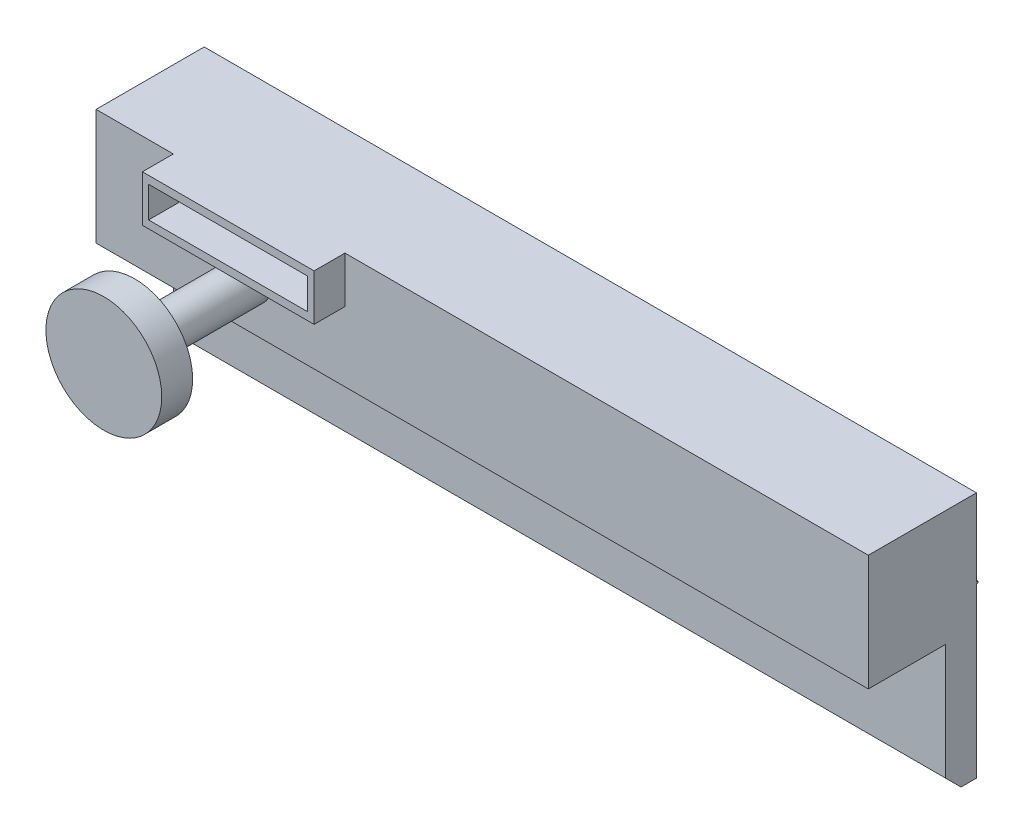
ISO-10303-21;
HEADER;
FILE_DESCRIPTION(('STEP AP214'),'2;1');
FILE_NAME('part.step','',(''),(''),'','','');
FILE_SCHEMA(('AUTOMOTIVE_DESIGN { 1 0 10303 214 1 1 1 1 }'));
ENDSEC;
DATA;
#1=APPLICATION_CONTEXT('core data for automotive mechanical design processes');
#2=APPLICATION_PROTOCOL_DEFINITION('international standard','automotive_design',2000,#1);
#3=PRODUCT_CONTEXT('',#1,'mechanical');
#4=PRODUCT('Part','Part','',(#3));
#5=PRODUCT_RELATED_PRODUCT_CATEGORY('part','',(#4));
#6=PRODUCT_DEFINITION_FORMATION('','',#4);
#7=PRODUCT_DEFINITION_CONTEXT('part definition',#1,'design');
#8=PRODUCT_DEFINITION('design','',#6,#7);
#9=PRODUCT_DEFINITION_SHAPE('','',#8);
#10=(LENGTH_UNIT() NAMED_UNIT(*) SI_UNIT(.MILLI.,.METRE.));
#11=(NAMED_UNIT(*) PLANE_ANGLE_UNIT() SI_UNIT($,.RADIAN.));
#12=(NAMED_UNIT(*) SI_UNIT($,.STERADIAN.) SOLID_ANGLE_UNIT());
#13=UNCERTAINTY_MEASURE_WITH_UNIT(LENGTH_MEASURE(1.E-05),#10,'distance_accuracy_value','');
#14=(GEOMETRIC_REPRESENTATION_CONTEXT(3) GLOBAL_UNCERTAINTY_ASSIGNED_CONTEXT((#13)) GLOBAL_UNIT_ASSIGNED_CONTEXT((#10,
#11,#12)) REPRESENTATION_CONTEXT('',''));
#15=CARTESIAN_POINT('',(0.,0.,0.));
#16=DIRECTION('',(0.,0.,1.));
#17=DIRECTION('',(1.,0.,0.));
#18=AXIS2_PLACEMENT_3D('',#15,#16,#17);
#19=CARTESIAN_POINT('',(0.,0.,0.));
#20=DIRECTION('',(0.,0.,-1.));
#21=DIRECTION('',(-1.,0.,0.));
#22=AXIS2_PLACEMENT_3D('',#19,#20,#21);
#23=PLANE('',#22);
#24=DIRECTION('',(1.,0.,0.));
#25=VECTOR('',#24,1.);
#26=CARTESIAN_POINT('',(127.,27.94,0.));
#27=LINE('',#26,#25);
#28=CARTESIAN_POINT('',(0.,27.94,0.));
#29=VERTEX_POINT('',#28);
#30=CARTESIAN_POINT('',(127.,27.94,0.));
#31=VERTEX_POINT('',#30);
#32=EDGE_CURVE('E185',#29,#31,#27,.T.);
#33=ORIENTED_EDGE('',*,*,#32,.F.);
#34=DIRECTION('',(0.,-1.,0.));
#35=VECTOR('',#34,1.);
#36=CARTESIAN_POINT('',(0.,0.,0.));
#37=LINE('',#36,#35);
#38=CARTESIAN_POINT('',(0.,40.64,0.));
#39=VERTEX_POINT('',#38);
#40=EDGE_CURVE('E314',#39,#29,#37,.T.);
#41=ORIENTED_EDGE('',*,*,#40,.F.);
#42=DIRECTION('',(-1.,0.,0.));
#43=VECTOR('',#42,1.);
#44=CARTESIAN_POINT('',(0.,40.64,0.));
#45=LINE('',#44,#43);
#46=CARTESIAN_POINT('',(127.,40.64,0.));
#47=VERTEX_POINT('',#46);
#48=EDGE_CURVE('E328',#47,#39,#45,.T.);
#49=ORIENTED_EDGE('',*,*,#48,.F.);
#50=DIRECTION('',(0.,1.,0.));
#51=VECTOR('',#50,1.);
#52=CARTESIAN_POINT('',(127.,0.,0.));
#53=LINE('',#52,#51);
#54=EDGE_CURVE('E49',#31,#47,#53,.T.);
#55=ORIENTED_EDGE('',*,*,#54,.F.);
#56=EDGE_LOOP('',(#33,#41,#49,#55));
#57=FACE_BOUND('',#56,.T.);
#58=ADVANCED_FACE('F32',(#57),#23,.T.);
#59=CARTESIAN_POINT('',(0.,0.,17.78));
#60=DIRECTION('',(0.,0.,1.));
#61=DIRECTION('',(1.,0.,0.));
#62=AXIS2_PLACEMENT_3D('',#59,#60,#61);
#63=PLANE('',#62);
#64=CARTESIAN_POINT('',(25.4,29.21,17.78));
#65=DIRECTION('',(0.,0.,1.));
#66=DIRECTION('',(1.,0.,0.));
#67=AXIS2_PLACEMENT_3D('',#64,#65,#66);
#68=CIRCLE('',#67,3.175);
#69=CARTESIAN_POINT('',(28.575,29.21,17.78));
#70=VERTEX_POINT('',#69);
#71=EDGE_CURVE('E273',#70,#70,#68,.T.);
#72=ORIENTED_EDGE('',*,*,#71,.F.);
#73=EDGE_LOOP('',(#72));
#74=FACE_BOUND('',#73,.T.);
#75=DIRECTION('',(1.,0.,0.));
#76=VECTOR('',#75,1.);
#77=CARTESIAN_POINT('',(12.7,33.02,17.78));
#78=LINE('',#77,#76);
#79=CARTESIAN_POINT('',(12.7,33.02,17.78));
#80=VERTEX_POINT('',#79);
#81=CARTESIAN_POINT('',(40.9273018803942,33.02,17.78));
#82=VERTEX_POINT('',#81);
#83=EDGE_CURVE('E253',#80,#82,#78,.T.);
#84=ORIENTED_EDGE('',*,*,#83,.F.);
#85=DIRECTION('',(0.,-1.,0.));
#86=VECTOR('',#85,1.);
#87=CARTESIAN_POINT('',(12.7,40.64,17.78));
#88=LINE('',#87,#86);
#89=CARTESIAN_POINT('',(12.7,40.64,17.78));
#90=VERTEX_POINT('',#89);
#91=EDGE_CURVE('E233',#90,#80,#88,.T.);
#92=ORIENTED_EDGE('',*,*,#91,.F.);
#93=DIRECTION('',(-1.,0.,0.));
#94=VECTOR('',#93,1.);
#95=CARTESIAN_POINT('',(0.,40.64,17.78));
#96=LINE('',#95,#94);
#97=CARTESIAN_POINT('',(0.,40.64,17.78));
#98=VERTEX_POINT('',#97);
#99=EDGE_CURVE('E290',#90,#98,#96,.T.);
#100=ORIENTED_EDGE('',*,*,#99,.T.);
#101=DIRECTION('',(0.,-1.,0.));
#102=VECTOR('',#101,1.);
#103=CARTESIAN_POINT('',(0.,40.64,17.78));
#104=LINE('',#103,#102);
#105=CARTESIAN_POINT('',(0.,21.59,17.78));
#106=VERTEX_POINT('',#105);
#107=EDGE_CURVE('E282',#98,#106,#104,.T.);
#108=ORIENTED_EDGE('',*,*,#107,.T.);
#109=DIRECTION('',(1.,0.,0.));
#110=VECTOR('',#109,1.);
#111=CARTESIAN_POINT('',(0.,21.59,17.78));
#112=LINE('',#111,#110);
#113=CARTESIAN_POINT('',(127.,21.59,17.78));
#114=VERTEX_POINT('',#113);
#115=EDGE_CURVE('E285',#106,#114,#112,.T.);
#116=ORIENTED_EDGE('',*,*,#115,.T.);
#117=DIRECTION('',(0.,1.,0.));
#118=VECTOR('',#117,1.);
#119=CARTESIAN_POINT('',(127.,40.64,17.78));
#120=LINE('',#119,#118);
#121=CARTESIAN_POINT('',(127.,40.64,17.78));
#122=VERTEX_POINT('',#121);
#123=EDGE_CURVE('E287',#114,#122,#120,.T.);
#124=ORIENTED_EDGE('',*,*,#123,.T.);
#125=CARTESIAN_POINT('',(40.9273018803942,40.64,17.78));
#126=VERTEX_POINT('',#125);
#127=EDGE_CURVE('E291',#122,#126,#96,.T.);
#128=ORIENTED_EDGE('',*,*,#127,.T.);
#129=DIRECTION('',(0.,1.,0.));
#130=VECTOR('',#129,1.);
#131=CARTESIAN_POINT('',(40.9273018803942,40.64,17.78));
#132=LINE('',#131,#130);
#133=EDGE_CURVE('E244',#82,#126,#132,.T.);
#134=ORIENTED_EDGE('',*,*,#133,.F.);
#135=EDGE_LOOP('',(#84,#92,#100,#108,#116,#124,#128,#134));
#136=FACE_BOUND('',#135,.T.);
#137=ADVANCED_FACE('F380',(#74,#136),#63,.T.);
#138=CARTESIAN_POINT('',(0.,0.,5.08));
#139=DIRECTION('',(0.,0.,-1.));
#140=DIRECTION('',(-1.,0.,0.));
#141=AXIS2_PLACEMENT_3D('',#138,#139,#140);
#142=PLANE('',#141);
#143=DIRECTION('',(1.,0.,0.));
#144=VECTOR('',#143,1.);
#145=CARTESIAN_POINT('',(0.,21.59,5.08));
#146=LINE('',#145,#144);
#147=CARTESIAN_POINT('',(0.,21.59,5.08));
#148=VERTEX_POINT('',#147);
#149=CARTESIAN_POINT('',(127.,21.59,5.08));
#150=VERTEX_POINT('',#149);
#151=EDGE_CURVE('E279',#148,#150,#146,.T.);
#152=ORIENTED_EDGE('',*,*,#151,.F.);
#153=DIRECTION('',(0.,-1.,0.));
#154=VECTOR('',#153,1.);
#155=CARTESIAN_POINT('',(0.,0.,5.08));
#156=LINE('',#155,#154);
#157=CARTESIAN_POINT('',(0.,2.54000000000003,5.08));
#158=VERTEX_POINT('',#157);
#159=EDGE_CURVE('E333',#148,#158,#156,.T.);
#160=ORIENTED_EDGE('',*,*,#159,.T.);
#161=DIRECTION('',(1.,0.,0.));
#162=VECTOR('',#161,1.);
#163=CARTESIAN_POINT('',(0.,2.54000000000003,5.08));
#164=LINE('',#163,#162);
#165=CARTESIAN_POINT('',(127.,2.54000000000003,5.08));
#166=VERTEX_POINT('',#165);
#167=EDGE_CURVE('E364',#158,#166,#164,.T.);
#168=ORIENTED_EDGE('',*,*,#167,.T.);
#169=DIRECTION('',(0.,1.,0.));
#170=VECTOR('',#169,1.);
#171=CARTESIAN_POINT('',(127.,0.,5.08));
#172=LINE('',#171,#170);
#173=EDGE_CURVE('E302',#166,#150,#172,.T.);
#174=ORIENTED_EDGE('',*,*,#173,.T.);
#175=EDGE_LOOP('',(#152,#160,#168,#174));
#176=FACE_BOUND('',#175,.T.);
#177=ADVANCED_FACE('F386',(#176),#142,.F.);
#178=CARTESIAN_POINT('',(0.,0.,5.08));
#179=DIRECTION('',(1.,0.,0.));
#180=DIRECTION('',(0.,0.,-1.));
#181=AXIS2_PLACEMENT_3D('',#178,#179,#180);
#182=PLANE('',#181);
#183=DIRECTION('',(0.,0.,-1.));
#184=VECTOR('',#183,1.);
#185=CARTESIAN_POINT('',(0.,0.,5.08));
#186=LINE('',#185,#184);
#187=CARTESIAN_POINT('',(0.,0.,2.53999999999996));
#188=VERTEX_POINT('',#187);
#189=CARTESIAN_POINT('',(0.,0.,0.));
#190=VERTEX_POINT('',#189);
#191=EDGE_CURVE('E357',#188,#190,#186,.T.);
#192=ORIENTED_EDGE('',*,*,#191,.F.);
#193=DIRECTION('',(0.,-0.707106781186546,-0.707106781186549));
#194=VECTOR('',#193,1.);
#195=CARTESIAN_POINT('',(0.,2.54000000000003,5.08));
#196=LINE('',#195,#194);
#197=EDGE_CURVE('E11',#188,#158,#196,.F.);
#198=ORIENTED_EDGE('',*,*,#197,.T.);
#199=ORIENTED_EDGE('',*,*,#159,.F.);
#200=DIRECTION('',(0.,0.,-1.));
#201=VECTOR('',#200,1.);
#202=CARTESIAN_POINT('',(0.,21.59,17.78));
#203=LINE('',#202,#201);
#204=EDGE_CURVE('E306',#106,#148,#203,.T.);
#205=ORIENTED_EDGE('',*,*,#204,.F.);
#206=ORIENTED_EDGE('',*,*,#107,.F.);
#207=DIRECTION('',(0.,0.,-1.));
#208=VECTOR('',#207,1.);
#209=CARTESIAN_POINT('',(0.,40.64,5.08));
#210=LINE('',#209,#208);
#211=EDGE_CURVE('E343',#98,#39,#210,.T.);
#212=ORIENTED_EDGE('',*,*,#211,.T.);
#213=ORIENTED_EDGE('',*,*,#40,.T.);
#214=DIRECTION('',(0.,0.,1.));
#215=VECTOR('',#214,1.);
#216=CARTESIAN_POINT('',(0.,27.94,-0.254));
#217=LINE('',#216,#215);
#218=CARTESIAN_POINT('',(0.,27.94,-0.254));
#219=VERTEX_POINT('',#218);
#220=EDGE_CURVE('E194',#219,#29,#217,.T.);
#221=ORIENTED_EDGE('',*,*,#220,.F.);
#222=DIRECTION('',(0.,1.,0.));
#223=VECTOR('',#222,1.);
#224=CARTESIAN_POINT('',(0.,27.94,-0.254));
#225=LINE('',#224,#223);
#226=CARTESIAN_POINT('',(0.,27.686,-0.254));
#227=VERTEX_POINT('',#226);
#228=EDGE_CURVE('E175',#227,#219,#225,.T.);
#229=ORIENTED_EDGE('',*,*,#228,.F.);
#230=DIRECTION('',(0.,0.,1.));
#231=VECTOR('',#230,1.);
#232=CARTESIAN_POINT('',(0.,27.686,-0.254));
#233=LINE('',#232,#231);
#234=CARTESIAN_POINT('',(0.,27.686,0.));
#235=VERTEX_POINT('',#234);
#236=EDGE_CURVE('E172',#227,#235,#233,.T.);
#237=ORIENTED_EDGE('',*,*,#236,.T.);
#238=EDGE_CURVE('E311',#235,#190,#37,.T.);
#239=ORIENTED_EDGE('',*,*,#238,.T.);
#240=EDGE_LOOP('',(#192,#198,#199,#205,#206,#212,#213,#221,#229,#237,#239));
#241=FACE_BOUND('',#240,.T.);
#242=ADVANCED_FACE('F350',(#241),#182,.F.);
#243=CARTESIAN_POINT('',(0.,0.,5.08));
#244=DIRECTION('',(0.,1.,0.));
#245=DIRECTION('',(0.,0.,1.));
#246=AXIS2_PLACEMENT_3D('',#243,#244,#245);
#247=PLANE('',#246);
#248=DIRECTION('',(0.,0.,-1.));
#249=VECTOR('',#248,1.);
#250=CARTESIAN_POINT('',(127.,0.,5.08));
#251=LINE('',#250,#249);
#252=CARTESIAN_POINT('',(127.,0.,2.53999999999996));
#253=VERTEX_POINT('',#252);
#254=CARTESIAN_POINT('',(127.,0.,0.));
#255=VERTEX_POINT('',#254);
#256=EDGE_CURVE('E342',#253,#255,#251,.T.);
#257=ORIENTED_EDGE('',*,*,#256,.F.);
#258=DIRECTION('',(-1.,0.,0.));
#259=VECTOR('',#258,1.);
#260=CARTESIAN_POINT('',(0.,0.,2.53999999999996));
#261=LINE('',#260,#259);
#262=EDGE_CURVE('E41',#253,#188,#261,.T.);
#263=ORIENTED_EDGE('',*,*,#262,.T.);
#264=ORIENTED_EDGE('',*,*,#191,.T.);
#265=DIRECTION('',(1.,0.,0.));
#266=VECTOR('',#265,1.);
#267=CARTESIAN_POINT('',(0.,0.,0.));
#268=LINE('',#267,#266);
#269=EDGE_CURVE('E318',#190,#255,#268,.T.);
#270=ORIENTED_EDGE('',*,*,#269,.T.);
#271=EDGE_LOOP('',(#257,#263,#264,#270));
#272=FACE_BOUND('',#271,.T.);
#273=ADVANCED_FACE('F362',(#272),#247,.F.);
#274=CARTESIAN_POINT('',(127.,0.,5.08));
#275=DIRECTION('',(-1.,0.,0.));
#276=DIRECTION('',(0.,0.,1.));
#277=AXIS2_PLACEMENT_3D('',#274,#275,#276);
#278=PLANE('',#277);
#279=ORIENTED_EDGE('',*,*,#173,.F.);
#280=DIRECTION('',(0.,0.707106781186546,0.707106781186549));
#281=VECTOR('',#280,1.);
#282=CARTESIAN_POINT('',(127.,2.54000000000003,5.08));
#283=LINE('',#282,#281);
#284=EDGE_CURVE('E414',#166,#253,#283,.F.);
#285=ORIENTED_EDGE('',*,*,#284,.T.);
#286=ORIENTED_EDGE('',*,*,#256,.T.);
#287=CARTESIAN_POINT('',(127.,27.686,0.));
#288=VERTEX_POINT('',#287);
#289=EDGE_CURVE('E189',#255,#288,#53,.T.);
#290=ORIENTED_EDGE('',*,*,#289,.T.);
#291=DIRECTION('',(0.,0.,1.));
#292=VECTOR('',#291,1.);
#293=CARTESIAN_POINT('',(127.,27.686,-0.254));
#294=LINE('',#293,#292);
#295=CARTESIAN_POINT('',(127.,27.686,-0.254));
#296=VERTEX_POINT('',#295);
#297=EDGE_CURVE('E170',#296,#288,#294,.T.);
#298=ORIENTED_EDGE('',*,*,#297,.F.);
#299=DIRECTION('',(0.,-1.,0.));
#300=VECTOR('',#299,1.);
#301=CARTESIAN_POINT('',(127.,27.94,-0.254));
#302=LINE('',#301,#300);
#303=CARTESIAN_POINT('',(127.,27.94,-0.254));
#304=VERTEX_POINT('',#303);
#305=EDGE_CURVE('E176',#304,#296,#302,.T.);
#306=ORIENTED_EDGE('',*,*,#305,.F.);
#307=DIRECTION('',(0.,0.,1.));
#308=VECTOR('',#307,1.);
#309=CARTESIAN_POINT('',(127.,27.94,-0.254));
#310=LINE('',#309,#308);
#311=EDGE_CURVE('E203',#304,#31,#310,.T.);
#312=ORIENTED_EDGE('',*,*,#311,.T.);
#313=ORIENTED_EDGE('',*,*,#54,.T.);
#314=DIRECTION('',(0.,0.,-1.));
#315=VECTOR('',#314,1.);
#316=CARTESIAN_POINT('',(127.,40.64,5.08));
#317=LINE('',#316,#315);
#318=EDGE_CURVE('E336',#122,#47,#317,.T.);
#319=ORIENTED_EDGE('',*,*,#318,.F.);
#320=ORIENTED_EDGE('',*,*,#123,.F.);
#321=DIRECTION('',(0.,0.,-1.));
#322=VECTOR('',#321,1.);
#323=CARTESIAN_POINT('',(127.,21.59,17.78));
#324=LINE('',#323,#322);
#325=EDGE_CURVE('E293',#114,#150,#324,.T.);
#326=ORIENTED_EDGE('',*,*,#325,.T.);
#327=EDGE_LOOP('',(#279,#285,#286,#290,#298,#306,#312,#313,#319,#320,#326));
#328=FACE_BOUND('',#327,.T.);
#329=ADVANCED_FACE('F188',(#328),#278,.F.);
#330=CARTESIAN_POINT('',(0.,40.64,5.08));
#331=DIRECTION('',(0.,-1.,0.));
#332=DIRECTION('',(0.,0.,-1.));
#333=AXIS2_PLACEMENT_3D('',#330,#331,#332);
#334=PLANE('',#333);
#335=ORIENTED_EDGE('',*,*,#48,.T.);
#336=ORIENTED_EDGE('',*,*,#211,.F.);
#337=ORIENTED_EDGE('',*,*,#99,.F.);
#338=DIRECTION('',(0.,0.,-1.));
#339=VECTOR('',#338,1.);
#340=CARTESIAN_POINT('',(12.7,40.64,22.86));
#341=LINE('',#340,#339);
#342=CARTESIAN_POINT('',(12.7,40.64,22.86));
#343=VERTEX_POINT('',#342);
#344=EDGE_CURVE('E250',#343,#90,#341,.T.);
#345=ORIENTED_EDGE('',*,*,#344,.F.);
#346=DIRECTION('',(-1.,0.,0.));
#347=VECTOR('',#346,1.);
#348=CARTESIAN_POINT('',(12.7,40.64,22.86));
#349=LINE('',#348,#347);
#350=CARTESIAN_POINT('',(40.9273018803942,40.64,22.86));
#351=VERTEX_POINT('',#350);
#352=EDGE_CURVE('E248',#351,#343,#349,.T.);
#353=ORIENTED_EDGE('',*,*,#352,.F.);
#354=DIRECTION('',(0.,0.,-1.));
#355=VECTOR('',#354,1.);
#356=CARTESIAN_POINT('',(40.9273018803942,40.64,22.86));
#357=LINE('',#356,#355);
#358=EDGE_CURVE('E260',#351,#126,#357,.T.);
#359=ORIENTED_EDGE('',*,*,#358,.T.);
#360=ORIENTED_EDGE('',*,*,#127,.F.);
#361=ORIENTED_EDGE('',*,*,#318,.T.);
#362=EDGE_LOOP('',(#335,#336,#337,#345,#353,#359,#360,#361));
#363=FACE_BOUND('',#362,.T.);
#364=ADVANCED_FACE('F339',(#363),#334,.F.);
#365=DIRECTION('',(-1.,0.,0.));
#366=VECTOR('',#365,1.);
#367=CARTESIAN_POINT('',(127.,27.686,0.));
#368=LINE('',#367,#366);
#369=EDGE_CURVE('E57',#288,#235,#368,.T.);
#370=ORIENTED_EDGE('',*,*,#369,.F.);
#371=ORIENTED_EDGE('',*,*,#289,.F.);
#372=ORIENTED_EDGE('',*,*,#269,.F.);
#373=ORIENTED_EDGE('',*,*,#238,.F.);
#374=EDGE_LOOP('',(#370,#371,#372,#373));
#375=FACE_BOUND('',#374,.T.);
#376=ADVANCED_FACE('F366',(#375),#23,.T.);
#377=CARTESIAN_POINT('',(0.,2.54000000000003,5.08));
#378=DIRECTION('',(0.,0.707106781186549,-0.707106781186546));
#379=DIRECTION('',(1.,0.,0.));
#380=AXIS2_PLACEMENT_3D('',#377,#378,#379);
#381=PLANE('',#380);
#382=ORIENTED_EDGE('',*,*,#197,.F.);
#383=ORIENTED_EDGE('',*,*,#262,.F.);
#384=ORIENTED_EDGE('',*,*,#284,.F.);
#385=ORIENTED_EDGE('',*,*,#167,.F.);
#386=EDGE_LOOP('',(#382,#383,#384,#385));
#387=FACE_BOUND('',#386,.T.);
#388=ADVANCED_FACE('F34',(#387),#381,.F.);
#389=CARTESIAN_POINT('',(0.,21.59,17.78));
#390=DIRECTION('',(0.,1.,0.));
#391=DIRECTION('',(0.,0.,1.));
#392=AXIS2_PLACEMENT_3D('',#389,#390,#391);
#393=PLANE('',#392);
#394=ORIENTED_EDGE('',*,*,#151,.T.);
#395=ORIENTED_EDGE('',*,*,#325,.F.);
#396=ORIENTED_EDGE('',*,*,#115,.F.);
#397=ORIENTED_EDGE('',*,*,#204,.T.);
#398=EDGE_LOOP('',(#394,#395,#396,#397));
#399=FACE_BOUND('',#398,.T.);
#400=ADVANCED_FACE('F374',(#399),#393,.F.);
#401=CARTESIAN_POINT('',(25.4,29.21,36.83));
#402=DIRECTION('',(0.,0.,-1.));
#403=DIRECTION('',(-1.,0.,0.));
#404=AXIS2_PLACEMENT_3D('',#401,#402,#403);
#405=CYLINDRICAL_SURFACE('',#404,3.175);
#406=CARTESIAN_POINT('',(25.4,29.21,36.83));
#407=DIRECTION('',(0.,0.,1.));
#408=DIRECTION('',(1.,0.,0.));
#409=AXIS2_PLACEMENT_3D('',#406,#407,#408);
#410=CIRCLE('',#409,3.175);
#411=CARTESIAN_POINT('',(28.575,29.21,36.83));
#412=VERTEX_POINT('',#411);
#413=EDGE_CURVE('E276',#412,#412,#410,.T.);
#414=ORIENTED_EDGE('',*,*,#413,.F.);
#415=EDGE_LOOP('',(#414));
#416=FACE_BOUND('',#415,.T.);
#417=ORIENTED_EDGE('',*,*,#71,.T.);
#418=EDGE_LOOP('',(#417));
#419=FACE_BOUND('',#418,.T.);
#420=ADVANCED_FACE('F397',(#416,#419),#405,.T.);
#421=CARTESIAN_POINT('',(25.4,29.21,36.83));
#422=DIRECTION('',(0.,0.,1.));
#423=DIRECTION('',(1.,0.,0.));
#424=AXIS2_PLACEMENT_3D('',#421,#422,#423);
#425=PLANE('',#424);
#426=CARTESIAN_POINT('',(25.4,29.21,36.83));
#427=DIRECTION('',(0.,0.,1.));
#428=DIRECTION('',(1.,0.,0.));
#429=AXIS2_PLACEMENT_3D('',#426,#427,#428);
#430=CIRCLE('',#429,9.525);
#431=CARTESIAN_POINT('',(34.925,29.21,36.83));
#432=VERTEX_POINT('',#431);
#433=EDGE_CURVE('E269',#432,#432,#430,.T.);
#434=ORIENTED_EDGE('',*,*,#433,.F.);
#435=EDGE_LOOP('',(#434));
#436=FACE_BOUND('',#435,.T.);
#437=ORIENTED_EDGE('',*,*,#413,.T.);
#438=EDGE_LOOP('',(#437));
#439=FACE_BOUND('',#438,.T.);
#440=ADVANCED_FACE('F404',(#436,#439),#425,.F.);
#441=CARTESIAN_POINT('',(25.4,29.21,41.91));
#442=DIRECTION('',(0.,0.,-1.));
#443=DIRECTION('',(-1.,0.,0.));
#444=AXIS2_PLACEMENT_3D('',#441,#442,#443);
#445=CYLINDRICAL_SURFACE('',#444,9.525);
#446=CARTESIAN_POINT('',(25.4,29.21,41.91));
#447=DIRECTION('',(0.,0.,1.));
#448=DIRECTION('',(1.,0.,0.));
#449=AXIS2_PLACEMENT_3D('',#446,#447,#448);
#450=CIRCLE('',#449,9.525);
#451=CARTESIAN_POINT('',(34.925,29.21,41.91));
#452=VERTEX_POINT('',#451);
#453=EDGE_CURVE('E270',#452,#452,#450,.T.);
#454=ORIENTED_EDGE('',*,*,#453,.F.);
#455=EDGE_LOOP('',(#454));
#456=FACE_BOUND('',#455,.T.);
#457=ORIENTED_EDGE('',*,*,#433,.T.);
#458=EDGE_LOOP('',(#457));
#459=FACE_BOUND('',#458,.T.);
#460=ADVANCED_FACE('F445',(#456,#459),#445,.T.);
#461=CARTESIAN_POINT('',(25.4,29.21,41.91));
#462=DIRECTION('',(0.,0.,1.));
#463=DIRECTION('',(1.,0.,0.));
#464=AXIS2_PLACEMENT_3D('',#461,#462,#463);
#465=PLANE('',#464);
#466=ORIENTED_EDGE('',*,*,#453,.T.);
#467=EDGE_LOOP('',(#466));
#468=FACE_BOUND('',#467,.T.);
#469=ADVANCED_FACE('F439',(#468),#465,.T.);
#470=CARTESIAN_POINT('',(12.7,40.64,22.86));
#471=DIRECTION('',(1.,0.,0.));
#472=DIRECTION('',(0.,1.,0.));
#473=AXIS2_PLACEMENT_3D('',#470,#471,#472);
#474=PLANE('',#473);
#475=ORIENTED_EDGE('',*,*,#91,.T.);
#476=DIRECTION('',(0.,0.,-1.));
#477=VECTOR('',#476,1.);
#478=CARTESIAN_POINT('',(12.7,33.02,22.86));
#479=LINE('',#478,#477);
#480=CARTESIAN_POINT('',(12.7,33.02,22.86));
#481=VERTEX_POINT('',#480);
#482=EDGE_CURVE('E266',#481,#80,#479,.T.);
#483=ORIENTED_EDGE('',*,*,#482,.F.);
#484=DIRECTION('',(0.,-1.,0.));
#485=VECTOR('',#484,1.);
#486=CARTESIAN_POINT('',(12.7,40.64,22.86));
#487=LINE('',#486,#485);
#488=EDGE_CURVE('E240',#343,#481,#487,.T.);
#489=ORIENTED_EDGE('',*,*,#488,.F.);
#490=ORIENTED_EDGE('',*,*,#344,.T.);
#491=EDGE_LOOP('',(#475,#483,#489,#490));
#492=FACE_BOUND('',#491,.T.);
#493=ADVANCED_FACE('F422',(#492),#474,.F.);
#494=CARTESIAN_POINT('',(12.7,33.02,22.86));
#495=DIRECTION('',(0.,1.,0.));
#496=DIRECTION('',(0.,0.,1.));
#497=AXIS2_PLACEMENT_3D('',#494,#495,#496);
#498=PLANE('',#497);
#499=ORIENTED_EDGE('',*,*,#83,.T.);
#500=DIRECTION('',(0.,0.,-1.));
#501=VECTOR('',#500,1.);
#502=CARTESIAN_POINT('',(40.9273018803942,33.02,22.86));
#503=LINE('',#502,#501);
#504=CARTESIAN_POINT('',(40.9273018803942,33.02,22.86));
#505=VERTEX_POINT('',#504);
#506=EDGE_CURVE('E263',#505,#82,#503,.T.);
#507=ORIENTED_EDGE('',*,*,#506,.F.);
#508=DIRECTION('',(1.,0.,0.));
#509=VECTOR('',#508,1.);
#510=CARTESIAN_POINT('',(12.7,33.02,22.86));
#511=LINE('',#510,#509);
#512=EDGE_CURVE('E243',#481,#505,#511,.T.);
#513=ORIENTED_EDGE('',*,*,#512,.F.);
#514=ORIENTED_EDGE('',*,*,#482,.T.);
#515=EDGE_LOOP('',(#499,#507,#513,#514));
#516=FACE_BOUND('',#515,.T.);
#517=ADVANCED_FACE('F431',(#516),#498,.F.);
#518=CARTESIAN_POINT('',(40.9273018803942,40.64,22.86));
#519=DIRECTION('',(-1.,0.,0.));
#520=DIRECTION('',(0.,-1.,0.));
#521=AXIS2_PLACEMENT_3D('',#518,#519,#520);
#522=PLANE('',#521);
#523=ORIENTED_EDGE('',*,*,#133,.T.);
#524=ORIENTED_EDGE('',*,*,#358,.F.);
#525=DIRECTION('',(0.,1.,0.));
#526=VECTOR('',#525,1.);
#527=CARTESIAN_POINT('',(40.9273018803942,40.64,22.86));
#528=LINE('',#527,#526);
#529=EDGE_CURVE('E246',#505,#351,#528,.T.);
#530=ORIENTED_EDGE('',*,*,#529,.F.);
#531=ORIENTED_EDGE('',*,*,#506,.T.);
#532=EDGE_LOOP('',(#523,#524,#530,#531));
#533=FACE_BOUND('',#532,.T.);
#534=ADVANCED_FACE('F429',(#533),#522,.F.);
#535=CARTESIAN_POINT('',(0.,0.,22.86));
#536=DIRECTION('',(0.,0.,1.));
#537=DIRECTION('',(1.,0.,0.));
#538=AXIS2_PLACEMENT_3D('',#535,#536,#537);
#539=PLANE('',#538);
#540=DIRECTION('',(0.,-1.,0.));
#541=VECTOR('',#540,1.);
#542=CARTESIAN_POINT('',(13.716,39.37,22.86));
#543=LINE('',#542,#541);
#544=CARTESIAN_POINT('',(13.716,39.37,22.86));
#545=VERTEX_POINT('',#544);
#546=CARTESIAN_POINT('',(13.716,34.29,22.86));
#547=VERTEX_POINT('',#546);
#548=EDGE_CURVE('E190',#545,#547,#543,.T.);
#549=ORIENTED_EDGE('',*,*,#548,.F.);
#550=DIRECTION('',(-1.,0.,0.));
#551=VECTOR('',#550,1.);
#552=CARTESIAN_POINT('',(13.716,39.37,22.86));
#553=LINE('',#552,#551);
#554=CARTESIAN_POINT('',(39.850311350139,39.37,22.86));
#555=VERTEX_POINT('',#554);
#556=EDGE_CURVE('E214',#555,#545,#553,.T.);
#557=ORIENTED_EDGE('',*,*,#556,.F.);
#558=DIRECTION('',(0.,1.,0.));
#559=VECTOR('',#558,1.);
#560=CARTESIAN_POINT('',(39.850311350139,39.37,22.86));
#561=LINE('',#560,#559);
#562=CARTESIAN_POINT('',(39.850311350139,34.29,22.86));
#563=VERTEX_POINT('',#562);
#564=EDGE_CURVE('E226',#563,#555,#561,.T.);
#565=ORIENTED_EDGE('',*,*,#564,.F.);
#566=DIRECTION('',(1.,0.,0.));
#567=VECTOR('',#566,1.);
#568=CARTESIAN_POINT('',(13.716,34.29,22.86));
#569=LINE('',#568,#567);
#570=EDGE_CURVE('E192',#547,#563,#569,.T.);
#571=ORIENTED_EDGE('',*,*,#570,.F.);
#572=EDGE_LOOP('',(#549,#557,#565,#571));
#573=FACE_BOUND('',#572,.T.);
#574=ORIENTED_EDGE('',*,*,#488,.T.);
#575=ORIENTED_EDGE('',*,*,#512,.T.);
#576=ORIENTED_EDGE('',*,*,#529,.T.);
#577=ORIENTED_EDGE('',*,*,#352,.T.);
#578=EDGE_LOOP('',(#574,#575,#576,#577));
#579=FACE_BOUND('',#578,.T.);
#580=ADVANCED_FACE('F424',(#573,#579),#539,.T.);
#581=CARTESIAN_POINT('',(13.716,39.37,17.78));
#582=DIRECTION('',(-1.,0.,0.));
#583=DIRECTION('',(0.,0.,1.));
#584=AXIS2_PLACEMENT_3D('',#581,#582,#583);
#585=PLANE('',#584);
#586=ORIENTED_EDGE('',*,*,#548,.T.);
#587=DIRECTION('',(0.,0.,1.));
#588=VECTOR('',#587,1.);
#589=CARTESIAN_POINT('',(13.716,34.29,17.78));
#590=LINE('',#589,#588);
#591=CARTESIAN_POINT('',(13.716,34.29,17.78));
#592=VERTEX_POINT('',#591);
#593=EDGE_CURVE('E222',#592,#547,#590,.T.);
#594=ORIENTED_EDGE('',*,*,#593,.F.);
#595=DIRECTION('',(0.,-1.,0.));
#596=VECTOR('',#595,1.);
#597=CARTESIAN_POINT('',(13.716,39.37,17.78));
#598=LINE('',#597,#596);
#599=CARTESIAN_POINT('',(13.716,39.37,17.78));
#600=VERTEX_POINT('',#599);
#601=EDGE_CURVE('E210',#600,#592,#598,.T.);
#602=ORIENTED_EDGE('',*,*,#601,.F.);
#603=DIRECTION('',(0.,0.,1.));
#604=VECTOR('',#603,1.);
#605=CARTESIAN_POINT('',(13.716,39.37,17.78));
#606=LINE('',#605,#604);
#607=EDGE_CURVE('E231',#600,#545,#606,.T.);
#608=ORIENTED_EDGE('',*,*,#607,.T.);
#609=EDGE_LOOP('',(#586,#594,#602,#608));
#610=FACE_BOUND('',#609,.T.);
#611=ADVANCED_FACE('F491',(#610),#585,.F.);
#612=CARTESIAN_POINT('',(13.716,39.37,17.78));
#613=DIRECTION('',(0.,1.,0.));
#614=DIRECTION('',(0.,0.,1.));
#615=AXIS2_PLACEMENT_3D('',#612,#613,#614);
#616=PLANE('',#615);
#617=ORIENTED_EDGE('',*,*,#556,.T.);
#618=ORIENTED_EDGE('',*,*,#607,.F.);
#619=DIRECTION('',(-1.,0.,0.));
#620=VECTOR('',#619,1.);
#621=CARTESIAN_POINT('',(13.716,39.37,17.78));
#622=LINE('',#621,#620);
#623=CARTESIAN_POINT('',(39.850311350139,39.37,17.78));
#624=VERTEX_POINT('',#623);
#625=EDGE_CURVE('E220',#624,#600,#622,.T.);
#626=ORIENTED_EDGE('',*,*,#625,.F.);
#627=DIRECTION('',(0.,0.,1.));
#628=VECTOR('',#627,1.);
#629=CARTESIAN_POINT('',(39.850311350139,39.37,17.78));
#630=LINE('',#629,#628);
#631=EDGE_CURVE('E234',#624,#555,#630,.T.);
#632=ORIENTED_EDGE('',*,*,#631,.T.);
#633=EDGE_LOOP('',(#617,#618,#626,#632));
#634=FACE_BOUND('',#633,.T.);
#635=ADVANCED_FACE('F500',(#634),#616,.F.);
#636=CARTESIAN_POINT('',(39.850311350139,39.37,17.78));
#637=DIRECTION('',(1.,0.,0.));
#638=DIRECTION('',(0.,1.,0.));
#639=AXIS2_PLACEMENT_3D('',#636,#637,#638);
#640=PLANE('',#639);
#641=ORIENTED_EDGE('',*,*,#564,.T.);
#642=ORIENTED_EDGE('',*,*,#631,.F.);
#643=DIRECTION('',(0.,1.,0.));
#644=VECTOR('',#643,1.);
#645=CARTESIAN_POINT('',(39.850311350139,39.37,17.78));
#646=LINE('',#645,#644);
#647=CARTESIAN_POINT('',(39.850311350139,34.29,17.78));
#648=VERTEX_POINT('',#647);
#649=EDGE_CURVE('E217',#648,#624,#646,.T.);
#650=ORIENTED_EDGE('',*,*,#649,.F.);
#651=DIRECTION('',(0.,0.,1.));
#652=VECTOR('',#651,1.);
#653=CARTESIAN_POINT('',(39.850311350139,34.29,17.78));
#654=LINE('',#653,#652);
#655=EDGE_CURVE('E236',#648,#563,#654,.T.);
#656=ORIENTED_EDGE('',*,*,#655,.T.);
#657=EDGE_LOOP('',(#641,#642,#650,#656));
#658=FACE_BOUND('',#657,.T.);
#659=ADVANCED_FACE('F510',(#658),#640,.F.);
#660=CARTESIAN_POINT('',(13.716,34.29,17.78));
#661=DIRECTION('',(0.,-1.,0.));
#662=DIRECTION('',(1.,0.,0.));
#663=AXIS2_PLACEMENT_3D('',#660,#661,#662);
#664=PLANE('',#663);
#665=ORIENTED_EDGE('',*,*,#570,.T.);
#666=ORIENTED_EDGE('',*,*,#655,.F.);
#667=DIRECTION('',(1.,0.,0.));
#668=VECTOR('',#667,1.);
#669=CARTESIAN_POINT('',(13.716,34.29,17.78));
#670=LINE('',#669,#668);
#671=EDGE_CURVE('E213',#592,#648,#670,.T.);
#672=ORIENTED_EDGE('',*,*,#671,.F.);
#673=ORIENTED_EDGE('',*,*,#593,.T.);
#674=EDGE_LOOP('',(#665,#666,#672,#673));
#675=FACE_BOUND('',#674,.T.);
#676=ADVANCED_FACE('F520',(#675),#664,.F.);
#677=CARTESIAN_POINT('',(0.,0.,17.78));
#678=DIRECTION('',(0.,0.,1.));
#679=DIRECTION('',(1.,0.,0.));
#680=AXIS2_PLACEMENT_3D('',#677,#678,#679);
#681=PLANE('',#680);
#682=ORIENTED_EDGE('',*,*,#601,.T.);
#683=ORIENTED_EDGE('',*,*,#671,.T.);
#684=ORIENTED_EDGE('',*,*,#649,.T.);
#685=ORIENTED_EDGE('',*,*,#625,.T.);
#686=EDGE_LOOP('',(#682,#683,#684,#685));
#687=FACE_BOUND('',#686,.T.);
#688=ADVANCED_FACE('F529',(#687),#681,.T.);
#689=CARTESIAN_POINT('',(127.,27.686,-0.254));
#690=DIRECTION('',(0.,1.,0.));
#691=DIRECTION('',(0.,0.,1.));
#692=AXIS2_PLACEMENT_3D('',#689,#690,#691);
#693=PLANE('',#692);
#694=ORIENTED_EDGE('',*,*,#369,.T.);
#695=ORIENTED_EDGE('',*,*,#236,.F.);
#696=DIRECTION('',(-1.,0.,0.));
#697=VECTOR('',#696,1.);
#698=CARTESIAN_POINT('',(127.,27.686,-0.254));
#699=LINE('',#698,#697);
#700=EDGE_CURVE('E166',#296,#227,#699,.T.);
#701=ORIENTED_EDGE('',*,*,#700,.F.);
#702=ORIENTED_EDGE('',*,*,#297,.T.);
#703=EDGE_LOOP('',(#694,#695,#701,#702));
#704=FACE_BOUND('',#703,.T.);
#705=ADVANCED_FACE('F168',(#704),#693,.F.);
#706=CARTESIAN_POINT('',(127.,27.94,-0.254));
#707=DIRECTION('',(0.,-1.,0.));
#708=DIRECTION('',(0.,0.,-1.));
#709=AXIS2_PLACEMENT_3D('',#706,#707,#708);
#710=PLANE('',#709);
#711=ORIENTED_EDGE('',*,*,#32,.T.);
#712=ORIENTED_EDGE('',*,*,#311,.F.);
#713=DIRECTION('',(1.,0.,0.));
#714=VECTOR('',#713,1.);
#715=CARTESIAN_POINT('',(127.,27.94,-0.254));
#716=LINE('',#715,#714);
#717=EDGE_CURVE('E181',#219,#304,#716,.T.);
#718=ORIENTED_EDGE('',*,*,#717,.F.);
#719=ORIENTED_EDGE('',*,*,#220,.T.);
#720=EDGE_LOOP('',(#711,#712,#718,#719));
#721=FACE_BOUND('',#720,.T.);
#722=ADVANCED_FACE('F353',(#721),#710,.F.);
#723=CARTESIAN_POINT('',(0.,0.,-0.254));
#724=DIRECTION('',(0.,0.,-1.));
#725=DIRECTION('',(-1.,0.,0.));
#726=AXIS2_PLACEMENT_3D('',#723,#724,#725);
#727=PLANE('',#726);
#728=ORIENTED_EDGE('',*,*,#305,.T.);
#729=ORIENTED_EDGE('',*,*,#700,.T.);
#730=ORIENTED_EDGE('',*,*,#228,.T.);
#731=ORIENTED_EDGE('',*,*,#717,.T.);
#732=EDGE_LOOP('',(#728,#729,#730,#731));
#733=FACE_BOUND('',#732,.T.);
#734=ADVANCED_FACE('F179',(#733),#727,.T.);
#735=CLOSED_SHELL('',(#58,#137,#177,#242,#273,#329,#364,#376,#388,#400,#420,#440,#460,#469,#493,
#517,#534,#580,#611,#635,#659,#676,#688,#705,#722,#734));
#736=MANIFOLD_SOLID_BREP('B2',#735);
#737=ADVANCED_BREP_SHAPE_REPRESENTATION('',(#18,#736),#14);
#738=SHAPE_DEFINITION_REPRESENTATION(#9,#737);
ENDSEC;
END-ISO-10303-21;
